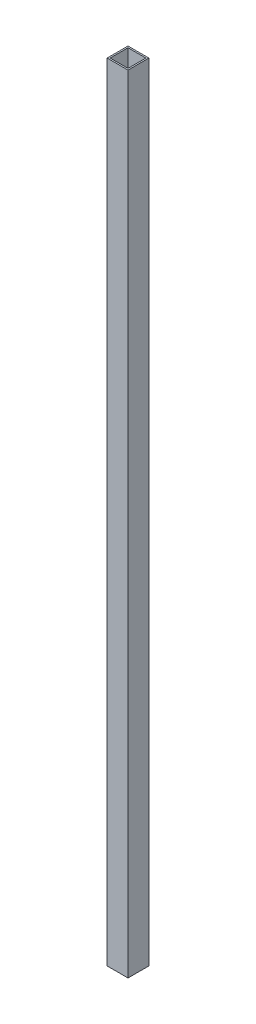
ISO-10303-21;
HEADER;
FILE_DESCRIPTION(('STEP AP214'),'2;1');
FILE_NAME('part.step','',(''),(''),'','','');
FILE_SCHEMA(('AUTOMOTIVE_DESIGN { 1 0 10303 214 1 1 1 1 }'));
ENDSEC;
DATA;
#1=APPLICATION_CONTEXT('core data for automotive mechanical design processes');
#2=APPLICATION_PROTOCOL_DEFINITION('international standard','automotive_design',2000,#1);
#3=PRODUCT_CONTEXT('',#1,'mechanical');
#4=PRODUCT('Part','Part','',(#3));
#5=PRODUCT_RELATED_PRODUCT_CATEGORY('part','',(#4));
#6=PRODUCT_DEFINITION_FORMATION('','',#4);
#7=PRODUCT_DEFINITION_CONTEXT('part definition',#1,'design');
#8=PRODUCT_DEFINITION('design','',#6,#7);
#9=PRODUCT_DEFINITION_SHAPE('','',#8);
#10=(LENGTH_UNIT() NAMED_UNIT(*) SI_UNIT(.MILLI.,.METRE.));
#11=(NAMED_UNIT(*) PLANE_ANGLE_UNIT() SI_UNIT($,.RADIAN.));
#12=(NAMED_UNIT(*) SI_UNIT($,.STERADIAN.) SOLID_ANGLE_UNIT());
#13=UNCERTAINTY_MEASURE_WITH_UNIT(LENGTH_MEASURE(1.E-05),#10,'distance_accuracy_value','');
#14=(GEOMETRIC_REPRESENTATION_CONTEXT(3) GLOBAL_UNCERTAINTY_ASSIGNED_CONTEXT((#13)) GLOBAL_UNIT_ASSIGNED_CONTEXT((#10,
#11,#12)) REPRESENTATION_CONTEXT('',''));
#15=CARTESIAN_POINT('',(0.,0.,0.));
#16=DIRECTION('',(0.,0.,1.));
#17=DIRECTION('',(1.,0.,0.));
#18=AXIS2_PLACEMENT_3D('',#15,#16,#17);
#19=CARTESIAN_POINT('',(3.175,-1676.4,22.225));
#20=DIRECTION('',(-1.,0.,0.));
#21=DIRECTION('',(0.,0.,1.));
#22=AXIS2_PLACEMENT_3D('',#19,#20,#21);
#23=PLANE('',#22);
#24=DIRECTION('',(0.,1.,0.));
#25=VECTOR('',#24,1.);
#26=CARTESIAN_POINT('',(3.175,-1676.4,41.275));
#27=LINE('',#26,#25);
#28=CARTESIAN_POINT('',(3.175,0.,41.275));
#29=VERTEX_POINT('',#28);
#30=CARTESIAN_POINT('',(3.175,-1676.4,41.275));
#31=VERTEX_POINT('',#30);
#32=EDGE_CURVE('E17',#29,#31,#27,.F.);
#33=ORIENTED_EDGE('',*,*,#32,.T.);
#34=DIRECTION('',(0.,0.,-1.));
#35=VECTOR('',#34,1.);
#36=CARTESIAN_POINT('',(3.175,-1676.4,22.225));
#37=LINE('',#36,#35);
#38=CARTESIAN_POINT('',(3.175,-1676.4,3.175));
#39=VERTEX_POINT('',#38);
#40=EDGE_CURVE('E120',#39,#31,#37,.F.);
#41=ORIENTED_EDGE('',*,*,#40,.F.);
#42=DIRECTION('',(0.,1.,0.));
#43=VECTOR('',#42,1.);
#44=CARTESIAN_POINT('',(3.175,-1676.4,3.175));
#45=LINE('',#44,#43);
#46=CARTESIAN_POINT('',(3.175,0.,3.175));
#47=VERTEX_POINT('',#46);
#48=EDGE_CURVE('E96',#47,#39,#45,.F.);
#49=ORIENTED_EDGE('',*,*,#48,.F.);
#50=DIRECTION('',(0.,0.,-1.));
#51=VECTOR('',#50,1.);
#52=CARTESIAN_POINT('',(3.175,0.,22.225));
#53=LINE('',#52,#51);
#54=EDGE_CURVE('E103',#47,#29,#53,.F.);
#55=ORIENTED_EDGE('',*,*,#54,.T.);
#56=EDGE_LOOP('',(#33,#41,#49,#55));
#57=FACE_BOUND('',#56,.T.);
#58=ADVANCED_FACE('F14',(#57),#23,.F.);
#59=CARTESIAN_POINT('',(22.225,-1676.4,41.275));
#60=DIRECTION('',(0.,0.,1.));
#61=DIRECTION('',(1.,0.,0.));
#62=AXIS2_PLACEMENT_3D('',#59,#60,#61);
#63=PLANE('',#62);
#64=DIRECTION('',(0.,1.,0.));
#65=VECTOR('',#64,1.);
#66=CARTESIAN_POINT('',(41.275,-1676.4,41.275));
#67=LINE('',#66,#65);
#68=CARTESIAN_POINT('',(41.275,-1676.4,41.275));
#69=VERTEX_POINT('',#68);
#70=CARTESIAN_POINT('',(41.275,0.,41.275));
#71=VERTEX_POINT('',#70);
#72=EDGE_CURVE('E82',#69,#71,#67,.T.);
#73=ORIENTED_EDGE('',*,*,#72,.F.);
#74=DIRECTION('',(1.,0.,0.));
#75=VECTOR('',#74,1.);
#76=CARTESIAN_POINT('',(22.225,-1676.4,41.275));
#77=LINE('',#76,#75);
#78=EDGE_CURVE('E124',#31,#69,#77,.T.);
#79=ORIENTED_EDGE('',*,*,#78,.F.);
#80=ORIENTED_EDGE('',*,*,#32,.F.);
#81=DIRECTION('',(1.,0.,0.));
#82=VECTOR('',#81,1.);
#83=CARTESIAN_POINT('',(22.225,0.,41.275));
#84=LINE('',#83,#82);
#85=EDGE_CURVE('E79',#29,#71,#84,.T.);
#86=ORIENTED_EDGE('',*,*,#85,.T.);
#87=EDGE_LOOP('',(#73,#79,#80,#86));
#88=FACE_BOUND('',#87,.T.);
#89=ADVANCED_FACE('F81',(#88),#63,.F.);
#90=CARTESIAN_POINT('',(41.275,-1676.4,22.225));
#91=DIRECTION('',(-1.,0.,0.));
#92=DIRECTION('',(0.,0.,1.));
#93=AXIS2_PLACEMENT_3D('',#90,#91,#92);
#94=PLANE('',#93);
#95=DIRECTION('',(0.,0.,-1.));
#96=VECTOR('',#95,1.);
#97=CARTESIAN_POINT('',(41.275,-1676.4,22.225));
#98=LINE('',#97,#96);
#99=CARTESIAN_POINT('',(41.275,-1676.4,3.175));
#100=VERTEX_POINT('',#99);
#101=EDGE_CURVE('E94',#69,#100,#98,.T.);
#102=ORIENTED_EDGE('',*,*,#101,.F.);
#103=ORIENTED_EDGE('',*,*,#72,.T.);
#104=DIRECTION('',(0.,0.,-1.));
#105=VECTOR('',#104,1.);
#106=CARTESIAN_POINT('',(41.275,0.,22.225));
#107=LINE('',#106,#105);
#108=CARTESIAN_POINT('',(41.275,0.,3.175));
#109=VERTEX_POINT('',#108);
#110=EDGE_CURVE('E87',#71,#109,#107,.T.);
#111=ORIENTED_EDGE('',*,*,#110,.T.);
#112=DIRECTION('',(0.,1.,0.));
#113=VECTOR('',#112,1.);
#114=CARTESIAN_POINT('',(41.275,-1676.4,3.175));
#115=LINE('',#114,#113);
#116=EDGE_CURVE('E108',#100,#109,#115,.T.);
#117=ORIENTED_EDGE('',*,*,#116,.F.);
#118=EDGE_LOOP('',(#102,#103,#111,#117));
#119=FACE_BOUND('',#118,.T.);
#120=ADVANCED_FACE('F91',(#119),#94,.T.);
#121=CARTESIAN_POINT('',(22.225,-1676.4,3.175));
#122=DIRECTION('',(0.,0.,1.));
#123=DIRECTION('',(1.,0.,0.));
#124=AXIS2_PLACEMENT_3D('',#121,#122,#123);
#125=PLANE('',#124);
#126=DIRECTION('',(1.,0.,0.));
#127=VECTOR('',#126,1.);
#128=CARTESIAN_POINT('',(22.225,-1676.4,3.175));
#129=LINE('',#128,#127);
#130=EDGE_CURVE('E115',#100,#39,#129,.F.);
#131=ORIENTED_EDGE('',*,*,#130,.F.);
#132=ORIENTED_EDGE('',*,*,#116,.T.);
#133=DIRECTION('',(1.,0.,0.));
#134=VECTOR('',#133,1.);
#135=CARTESIAN_POINT('',(22.225,0.,3.175));
#136=LINE('',#135,#134);
#137=EDGE_CURVE('E101',#109,#47,#136,.F.);
#138=ORIENTED_EDGE('',*,*,#137,.T.);
#139=ORIENTED_EDGE('',*,*,#48,.T.);
#140=EDGE_LOOP('',(#131,#132,#138,#139));
#141=FACE_BOUND('',#140,.T.);
#142=ADVANCED_FACE('F114',(#141),#125,.T.);
#143=CARTESIAN_POINT('',(22.225,-1676.4,0.));
#144=DIRECTION('',(0.,0.,1.));
#145=DIRECTION('',(1.,0.,0.));
#146=AXIS2_PLACEMENT_3D('',#143,#144,#145);
#147=PLANE('',#146);
#148=DIRECTION('',(0.,1.,0.));
#149=VECTOR('',#148,1.);
#150=CARTESIAN_POINT('',(44.45,-1676.4,0.));
#151=LINE('',#150,#149);
#152=CARTESIAN_POINT('',(44.45,0.,0.));
#153=VERTEX_POINT('',#152);
#154=CARTESIAN_POINT('',(44.45,-1676.4,0.));
#155=VERTEX_POINT('',#154);
#156=EDGE_CURVE('E121',#153,#155,#151,.F.);
#157=ORIENTED_EDGE('',*,*,#156,.T.);
#158=DIRECTION('',(1.,0.,0.));
#159=VECTOR('',#158,1.);
#160=CARTESIAN_POINT('',(22.225,-1676.4,0.));
#161=LINE('',#160,#159);
#162=CARTESIAN_POINT('',(0.,-1676.4,0.));
#163=VERTEX_POINT('',#162);
#164=EDGE_CURVE('E130',#163,#155,#161,.T.);
#165=ORIENTED_EDGE('',*,*,#164,.F.);
#166=DIRECTION('',(0.,1.,0.));
#167=VECTOR('',#166,1.);
#168=CARTESIAN_POINT('',(0.,-1676.4,0.));
#169=LINE('',#168,#167);
#170=CARTESIAN_POINT('',(0.,0.,0.));
#171=VERTEX_POINT('',#170);
#172=EDGE_CURVE('E135',#171,#163,#169,.F.);
#173=ORIENTED_EDGE('',*,*,#172,.F.);
#174=DIRECTION('',(1.,0.,0.));
#175=VECTOR('',#174,1.);
#176=CARTESIAN_POINT('',(22.225,0.,0.));
#177=LINE('',#176,#175);
#178=EDGE_CURVE('E88',#171,#153,#177,.T.);
#179=ORIENTED_EDGE('',*,*,#178,.T.);
#180=EDGE_LOOP('',(#157,#165,#173,#179));
#181=FACE_BOUND('',#180,.T.);
#182=ADVANCED_FACE('F164',(#181),#147,.F.);
#183=CARTESIAN_POINT('',(22.225,0.,22.225));
#184=DIRECTION('',(0.,-1.,0.));
#185=DIRECTION('',(0.,0.,-1.));
#186=AXIS2_PLACEMENT_3D('',#183,#184,#185);
#187=PLANE('',#186);
#188=ORIENTED_EDGE('',*,*,#137,.F.);
#189=ORIENTED_EDGE('',*,*,#110,.F.);
#190=ORIENTED_EDGE('',*,*,#85,.F.);
#191=ORIENTED_EDGE('',*,*,#54,.F.);
#192=EDGE_LOOP('',(#188,#189,#190,#191));
#193=FACE_BOUND('',#192,.T.);
#194=DIRECTION('',(1.,0.,0.));
#195=VECTOR('',#194,1.);
#196=CARTESIAN_POINT('',(22.225,0.,44.45));
#197=LINE('',#196,#195);
#198=CARTESIAN_POINT('',(44.45,0.,44.45));
#199=VERTEX_POINT('',#198);
#200=CARTESIAN_POINT('',(0.,0.,44.45));
#201=VERTEX_POINT('',#200);
#202=EDGE_CURVE('E240',#199,#201,#197,.F.);
#203=ORIENTED_EDGE('',*,*,#202,.F.);
#204=DIRECTION('',(0.,0.,1.));
#205=VECTOR('',#204,1.);
#206=CARTESIAN_POINT('',(44.45,0.,22.225));
#207=LINE('',#206,#205);
#208=EDGE_CURVE('E239',#199,#153,#207,.F.);
#209=ORIENTED_EDGE('',*,*,#208,.T.);
#210=ORIENTED_EDGE('',*,*,#178,.F.);
#211=DIRECTION('',(0.,0.,1.));
#212=VECTOR('',#211,1.);
#213=CARTESIAN_POINT('',(0.,0.,22.225));
#214=LINE('',#213,#212);
#215=EDGE_CURVE('E137',#201,#171,#214,.F.);
#216=ORIENTED_EDGE('',*,*,#215,.F.);
#217=EDGE_LOOP('',(#203,#209,#210,#216));
#218=FACE_BOUND('',#217,.T.);
#219=ADVANCED_FACE('F98',(#193,#218),#187,.F.);
#220=CARTESIAN_POINT('',(0.,-1676.4,22.225));
#221=DIRECTION('',(-1.,0.,0.));
#222=DIRECTION('',(0.,0.,1.));
#223=AXIS2_PLACEMENT_3D('',#220,#221,#222);
#224=PLANE('',#223);
#225=DIRECTION('',(0.,0.,-1.));
#226=VECTOR('',#225,1.);
#227=CARTESIAN_POINT('',(0.,-1676.4,22.225));
#228=LINE('',#227,#226);
#229=CARTESIAN_POINT('',(0.,-1676.4,44.45));
#230=VERTEX_POINT('',#229);
#231=EDGE_CURVE('E132',#230,#163,#228,.T.);
#232=ORIENTED_EDGE('',*,*,#231,.F.);
#233=DIRECTION('',(0.,1.,0.));
#234=VECTOR('',#233,1.);
#235=CARTESIAN_POINT('',(0.,-1676.4,44.45));
#236=LINE('',#235,#234);
#237=EDGE_CURVE('E245',#201,#230,#236,.F.);
#238=ORIENTED_EDGE('',*,*,#237,.F.);
#239=ORIENTED_EDGE('',*,*,#215,.T.);
#240=ORIENTED_EDGE('',*,*,#172,.T.);
#241=EDGE_LOOP('',(#232,#238,#239,#240));
#242=FACE_BOUND('',#241,.T.);
#243=ADVANCED_FACE('F158',(#242),#224,.T.);
#244=CARTESIAN_POINT('',(22.225,-1676.4,22.225));
#245=DIRECTION('',(0.,-1.,0.));
#246=DIRECTION('',(0.,0.,-1.));
#247=AXIS2_PLACEMENT_3D('',#244,#245,#246);
#248=PLANE('',#247);
#249=ORIENTED_EDGE('',*,*,#101,.T.);
#250=ORIENTED_EDGE('',*,*,#130,.T.);
#251=ORIENTED_EDGE('',*,*,#40,.T.);
#252=ORIENTED_EDGE('',*,*,#78,.T.);
#253=EDGE_LOOP('',(#249,#250,#251,#252));
#254=FACE_BOUND('',#253,.T.);
#255=DIRECTION('',(0.,0.,1.));
#256=VECTOR('',#255,1.);
#257=CARTESIAN_POINT('',(44.45,-1676.4,22.225));
#258=LINE('',#257,#256);
#259=CARTESIAN_POINT('',(44.45,-1676.4,44.45));
#260=VERTEX_POINT('',#259);
#261=EDGE_CURVE('E32',#155,#260,#258,.T.);
#262=ORIENTED_EDGE('',*,*,#261,.T.);
#263=DIRECTION('',(1.,0.,0.));
#264=VECTOR('',#263,1.);
#265=CARTESIAN_POINT('',(22.225,-1676.4,44.45));
#266=LINE('',#265,#264);
#267=EDGE_CURVE('E23',#230,#260,#266,.T.);
#268=ORIENTED_EDGE('',*,*,#267,.F.);
#269=ORIENTED_EDGE('',*,*,#231,.T.);
#270=ORIENTED_EDGE('',*,*,#164,.T.);
#271=EDGE_LOOP('',(#262,#268,#269,#270));
#272=FACE_BOUND('',#271,.T.);
#273=ADVANCED_FACE('F119',(#254,#272),#248,.T.);
#274=CARTESIAN_POINT('',(44.45,-1676.4,22.225));
#275=DIRECTION('',(-1.,0.,0.));
#276=DIRECTION('',(0.,0.,1.));
#277=AXIS2_PLACEMENT_3D('',#274,#275,#276);
#278=PLANE('',#277);
#279=DIRECTION('',(0.,1.,0.));
#280=VECTOR('',#279,1.);
#281=CARTESIAN_POINT('',(44.45,-1676.4,44.45));
#282=LINE('',#281,#280);
#283=EDGE_CURVE('E9',#260,#199,#282,.T.);
#284=ORIENTED_EDGE('',*,*,#283,.F.);
#285=ORIENTED_EDGE('',*,*,#261,.F.);
#286=ORIENTED_EDGE('',*,*,#156,.F.);
#287=ORIENTED_EDGE('',*,*,#208,.F.);
#288=EDGE_LOOP('',(#284,#285,#286,#287));
#289=FACE_BOUND('',#288,.T.);
#290=ADVANCED_FACE('F146',(#289),#278,.F.);
#291=CARTESIAN_POINT('',(22.225,-1676.4,44.45));
#292=DIRECTION('',(0.,0.,1.));
#293=DIRECTION('',(1.,0.,0.));
#294=AXIS2_PLACEMENT_3D('',#291,#292,#293);
#295=PLANE('',#294);
#296=ORIENTED_EDGE('',*,*,#267,.T.);
#297=ORIENTED_EDGE('',*,*,#283,.T.);
#298=ORIENTED_EDGE('',*,*,#202,.T.);
#299=ORIENTED_EDGE('',*,*,#237,.T.);
#300=EDGE_LOOP('',(#296,#297,#298,#299));
#301=FACE_BOUND('',#300,.T.);
#302=ADVANCED_FACE('F144',(#301),#295,.T.);
#303=CLOSED_SHELL('',(#58,#89,#120,#142,#182,#219,#243,#273,#290,#302));
#304=MANIFOLD_SOLID_BREP('B1',#303);
#305=ADVANCED_BREP_SHAPE_REPRESENTATION('',(#18,#304),#14);
#306=SHAPE_DEFINITION_REPRESENTATION(#9,#305);
ENDSEC;
END-ISO-10303-21;
